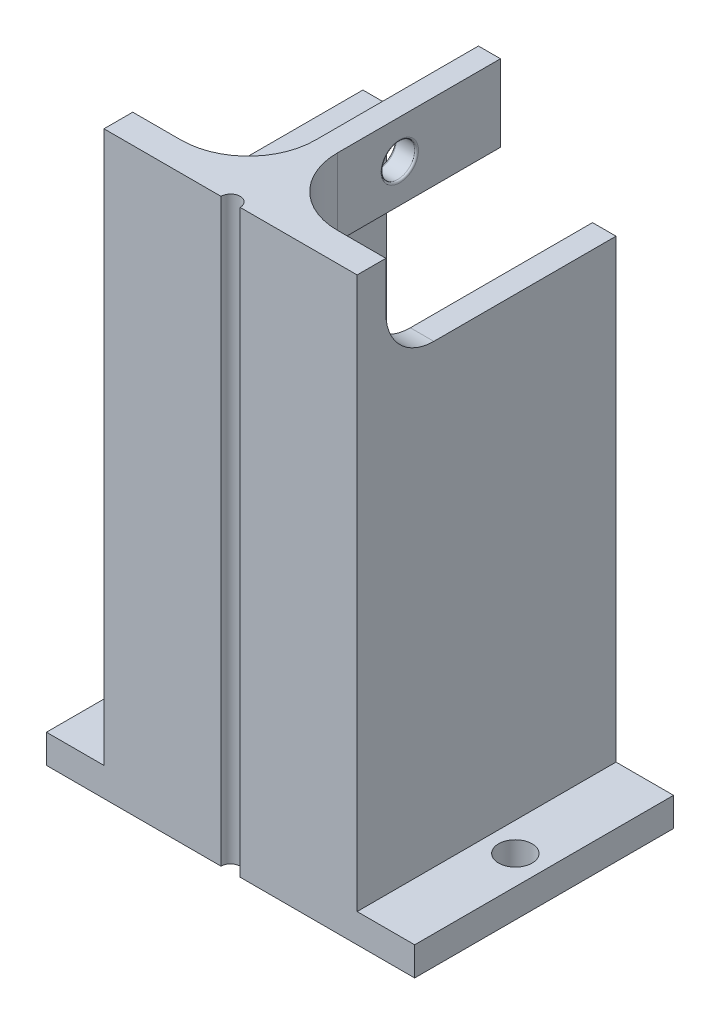
ISO-10303-21;
HEADER;
FILE_DESCRIPTION(('STEP AP214'),'2;1');
FILE_NAME('part.step','',(''),(''),'','','');
FILE_SCHEMA(('AUTOMOTIVE_DESIGN { 1 0 10303 214 1 1 1 1 }'));
ENDSEC;
DATA;
#1=APPLICATION_CONTEXT('core data for automotive mechanical design processes');
#2=APPLICATION_PROTOCOL_DEFINITION('international standard','automotive_design',2000,#1);
#3=PRODUCT_CONTEXT('',#1,'mechanical');
#4=PRODUCT('Part','Part','',(#3));
#5=PRODUCT_RELATED_PRODUCT_CATEGORY('part','',(#4));
#6=PRODUCT_DEFINITION_FORMATION('','',#4);
#7=PRODUCT_DEFINITION_CONTEXT('part definition',#1,'design');
#8=PRODUCT_DEFINITION('design','',#6,#7);
#9=PRODUCT_DEFINITION_SHAPE('','',#8);
#10=(LENGTH_UNIT() NAMED_UNIT(*) SI_UNIT(.MILLI.,.METRE.));
#11=(NAMED_UNIT(*) PLANE_ANGLE_UNIT() SI_UNIT($,.RADIAN.));
#12=(NAMED_UNIT(*) SI_UNIT($,.STERADIAN.) SOLID_ANGLE_UNIT());
#13=UNCERTAINTY_MEASURE_WITH_UNIT(LENGTH_MEASURE(1.E-05),#10,'distance_accuracy_value','');
#14=(GEOMETRIC_REPRESENTATION_CONTEXT(3) GLOBAL_UNCERTAINTY_ASSIGNED_CONTEXT((#13)) GLOBAL_UNIT_ASSIGNED_CONTEXT((#10,
#11,#12)) REPRESENTATION_CONTEXT('',''));
#15=CARTESIAN_POINT('',(0.,0.,0.));
#16=DIRECTION('',(0.,0.,1.));
#17=DIRECTION('',(1.,0.,0.));
#18=AXIS2_PLACEMENT_3D('',#15,#16,#17);
#19=CARTESIAN_POINT('',(-13.2,30.25,27.));
#20=DIRECTION('',(1.,0.,0.));
#21=DIRECTION('',(0.,1.,0.));
#22=AXIS2_PLACEMENT_3D('',#19,#20,#21);
#23=PLANE('',#22);
#24=DIRECTION('',(0.,0.,-1.));
#25=VECTOR('',#24,1.);
#26=CARTESIAN_POINT('',(-13.2,-27.25,0.));
#27=LINE('',#26,#25);
#28=CARTESIAN_POINT('',(-13.2,-27.25,27.));
#29=VERTEX_POINT('',#28);
#30=CARTESIAN_POINT('',(-13.2,-27.25,0.));
#31=VERTEX_POINT('',#30);
#32=EDGE_CURVE('E52',#29,#31,#27,.T.);
#33=ORIENTED_EDGE('',*,*,#32,.F.);
#34=DIRECTION('',(0.,-1.,0.));
#35=VECTOR('',#34,1.);
#36=CARTESIAN_POINT('',(-13.2,30.25,27.));
#37=LINE('',#36,#35);
#38=CARTESIAN_POINT('',(-13.2,30.25,27.));
#39=VERTEX_POINT('',#38);
#40=EDGE_CURVE('E229',#39,#29,#37,.T.);
#41=ORIENTED_EDGE('',*,*,#40,.F.);
#42=DIRECTION('',(0.,0.,-1.));
#43=VECTOR('',#42,1.);
#44=CARTESIAN_POINT('',(-13.2,30.25,27.));
#45=LINE('',#44,#43);
#46=CARTESIAN_POINT('',(-13.2,30.25,24.));
#47=VERTEX_POINT('',#46);
#48=EDGE_CURVE('E285',#39,#47,#45,.T.);
#49=ORIENTED_EDGE('',*,*,#48,.T.);
#50=DIRECTION('',(0.,1.,0.));
#51=VECTOR('',#50,1.);
#52=CARTESIAN_POINT('',(-13.2,30.25,24.));
#53=LINE('',#52,#51);
#54=CARTESIAN_POINT('',(-13.2,25.25,24.));
#55=VERTEX_POINT('',#54);
#56=EDGE_CURVE('E416',#55,#47,#53,.T.);
#57=ORIENTED_EDGE('',*,*,#56,.F.);
#58=CARTESIAN_POINT('',(-13.2,25.25,19.));
#59=DIRECTION('',(1.,0.,0.));
#60=DIRECTION('',(0.,1.,0.));
#61=AXIS2_PLACEMENT_3D('',#58,#59,#60);
#62=CIRCLE('',#61,5.);
#63=CARTESIAN_POINT('',(-13.2,20.25,19.));
#64=VERTEX_POINT('',#63);
#65=EDGE_CURVE('E465',#55,#64,#62,.T.);
#66=ORIENTED_EDGE('',*,*,#65,.T.);
#67=DIRECTION('',(0.,0.,1.));
#68=VECTOR('',#67,1.);
#69=CARTESIAN_POINT('',(-13.2,20.25,0.));
#70=LINE('',#69,#68);
#71=CARTESIAN_POINT('',(-13.2,20.25,0.));
#72=VERTEX_POINT('',#71);
#73=EDGE_CURVE('E411',#72,#64,#70,.T.);
#74=ORIENTED_EDGE('',*,*,#73,.F.);
#75=DIRECTION('',(0.,-1.,0.));
#76=VECTOR('',#75,1.);
#77=CARTESIAN_POINT('',(-13.2,30.25,0.));
#78=LINE('',#77,#76);
#79=EDGE_CURVE('E272',#72,#31,#78,.T.);
#80=ORIENTED_EDGE('',*,*,#79,.T.);
#81=EDGE_LOOP('',(#33,#41,#49,#57,#66,#74,#80));
#82=FACE_BOUND('',#81,.T.);
#83=ADVANCED_FACE('F35',(#82),#23,.F.);
#84=CARTESIAN_POINT('',(13.2,30.25,27.));
#85=DIRECTION('',(-1.,0.,0.));
#86=DIRECTION('',(0.,-1.,0.));
#87=AXIS2_PLACEMENT_3D('',#84,#85,#86);
#88=PLANE('',#87);
#89=DIRECTION('',(0.,0.,1.));
#90=VECTOR('',#89,1.);
#91=CARTESIAN_POINT('',(13.2,-27.25,0.));
#92=LINE('',#91,#90);
#93=CARTESIAN_POINT('',(13.2,-27.25,0.));
#94=VERTEX_POINT('',#93);
#95=CARTESIAN_POINT('',(13.2,-27.25,27.));
#96=VERTEX_POINT('',#95);
#97=EDGE_CURVE('E60',#94,#96,#92,.T.);
#98=ORIENTED_EDGE('',*,*,#97,.F.);
#99=DIRECTION('',(0.,1.,0.));
#100=VECTOR('',#99,1.);
#101=CARTESIAN_POINT('',(13.2,30.25,0.));
#102=LINE('',#101,#100);
#103=CARTESIAN_POINT('',(13.2,20.25,0.));
#104=VERTEX_POINT('',#103);
#105=EDGE_CURVE('E262',#94,#104,#102,.T.);
#106=ORIENTED_EDGE('',*,*,#105,.T.);
#107=DIRECTION('',(0.,0.,1.));
#108=VECTOR('',#107,1.);
#109=CARTESIAN_POINT('',(13.2,20.25,0.));
#110=LINE('',#109,#108);
#111=CARTESIAN_POINT('',(13.2,20.25,19.));
#112=VERTEX_POINT('',#111);
#113=EDGE_CURVE('E412',#104,#112,#110,.T.);
#114=ORIENTED_EDGE('',*,*,#113,.T.);
#115=CARTESIAN_POINT('',(13.2,25.25,19.));
#116=DIRECTION('',(-1.,0.,0.));
#117=DIRECTION('',(0.,-1.,0.));
#118=AXIS2_PLACEMENT_3D('',#115,#116,#117);
#119=CIRCLE('',#118,5.);
#120=CARTESIAN_POINT('',(13.2,25.25,24.));
#121=VERTEX_POINT('',#120);
#122=EDGE_CURVE('E458',#112,#121,#119,.T.);
#123=ORIENTED_EDGE('',*,*,#122,.T.);
#124=DIRECTION('',(0.,1.,0.));
#125=VECTOR('',#124,1.);
#126=CARTESIAN_POINT('',(13.2,30.25,24.));
#127=LINE('',#126,#125);
#128=CARTESIAN_POINT('',(13.2,30.25,24.));
#129=VERTEX_POINT('',#128);
#130=EDGE_CURVE('E415',#121,#129,#127,.T.);
#131=ORIENTED_EDGE('',*,*,#130,.T.);
#132=DIRECTION('',(0.,0.,-1.));
#133=VECTOR('',#132,1.);
#134=CARTESIAN_POINT('',(13.2,30.25,27.));
#135=LINE('',#134,#133);
#136=CARTESIAN_POINT('',(13.2,30.25,27.));
#137=VERTEX_POINT('',#136);
#138=EDGE_CURVE('E288',#137,#129,#135,.T.);
#139=ORIENTED_EDGE('',*,*,#138,.F.);
#140=DIRECTION('',(0.,1.,0.));
#141=VECTOR('',#140,1.);
#142=CARTESIAN_POINT('',(13.2,30.25,27.));
#143=LINE('',#142,#141);
#144=EDGE_CURVE('E451',#96,#137,#143,.T.);
#145=ORIENTED_EDGE('',*,*,#144,.F.);
#146=EDGE_LOOP('',(#98,#106,#114,#123,#131,#139,#145));
#147=FACE_BOUND('',#146,.T.);
#148=ADVANCED_FACE('F355',(#147),#88,.F.);
#149=CARTESIAN_POINT('',(0.,0.,27.));
#150=DIRECTION('',(0.,0.,-1.));
#151=DIRECTION('',(-1.,0.,0.));
#152=AXIS2_PLACEMENT_3D('',#149,#150,#151);
#153=PLANE('',#152);
#154=DIRECTION('',(-1.,0.,0.));
#155=VECTOR('',#154,1.);
#156=CARTESIAN_POINT('',(13.2,30.25,27.));
#157=LINE('',#156,#155);
#158=CARTESIAN_POINT('',(1.00000000000001,30.25,27.));
#159=VERTEX_POINT('',#158);
#160=EDGE_CURVE('E279',#137,#159,#157,.T.);
#161=ORIENTED_EDGE('',*,*,#160,.T.);
#162=DIRECTION('',(0.,-1.,0.));
#163=VECTOR('',#162,1.);
#164=CARTESIAN_POINT('',(1.00000000000001,30.25,27.));
#165=LINE('',#164,#163);
#166=CARTESIAN_POINT('',(1.00000000000001,-30.25,27.));
#167=VERTEX_POINT('',#166);
#168=EDGE_CURVE('E11',#159,#167,#165,.T.);
#169=ORIENTED_EDGE('',*,*,#168,.T.);
#170=DIRECTION('',(1.,0.,0.));
#171=VECTOR('',#170,1.);
#172=CARTESIAN_POINT('',(13.2,-30.25,27.));
#173=LINE('',#172,#171);
#174=CARTESIAN_POINT('',(19.2,-30.25,27.));
#175=VERTEX_POINT('',#174);
#176=EDGE_CURVE('E452',#167,#175,#173,.T.);
#177=ORIENTED_EDGE('',*,*,#176,.T.);
#178=DIRECTION('',(0.,-1.,0.));
#179=VECTOR('',#178,1.);
#180=CARTESIAN_POINT('',(19.2,-27.25,27.));
#181=LINE('',#180,#179);
#182=CARTESIAN_POINT('',(19.2,-27.25,27.));
#183=VERTEX_POINT('',#182);
#184=EDGE_CURVE('E270',#183,#175,#181,.T.);
#185=ORIENTED_EDGE('',*,*,#184,.F.);
#186=DIRECTION('',(1.,0.,0.));
#187=VECTOR('',#186,1.);
#188=CARTESIAN_POINT('',(0.,-27.25,27.));
#189=LINE('',#188,#187);
#190=EDGE_CURVE('E254',#96,#183,#189,.T.);
#191=ORIENTED_EDGE('',*,*,#190,.F.);
#192=ORIENTED_EDGE('',*,*,#144,.T.);
#193=EDGE_LOOP('',(#161,#169,#177,#185,#191,#192));
#194=FACE_BOUND('',#193,.T.);
#195=ADVANCED_FACE('F361',(#194),#153,.F.);
#196=CARTESIAN_POINT('',(0.,0.,24.));
#197=DIRECTION('',(0.,0.,1.));
#198=DIRECTION('',(1.,0.,0.));
#199=AXIS2_PLACEMENT_3D('',#196,#197,#198);
#200=PLANE('',#199);
#201=DIRECTION('',(0.,1.,0.));
#202=VECTOR('',#201,1.);
#203=CARTESIAN_POINT('',(-10.75,30.25,24.));
#204=LINE('',#203,#202);
#205=CARTESIAN_POINT('',(-10.75,-30.25,24.));
#206=VERTEX_POINT('',#205);
#207=CARTESIAN_POINT('',(-10.75,25.25,24.));
#208=VERTEX_POINT('',#207);
#209=EDGE_CURVE('E437',#206,#208,#204,.T.);
#210=ORIENTED_EDGE('',*,*,#209,.T.);
#211=DIRECTION('',(-1.,0.,0.));
#212=VECTOR('',#211,1.);
#213=CARTESIAN_POINT('',(-13.2,25.25,24.));
#214=LINE('',#213,#212);
#215=EDGE_CURVE('E471',#208,#55,#214,.T.);
#216=ORIENTED_EDGE('',*,*,#215,.T.);
#217=ORIENTED_EDGE('',*,*,#56,.T.);
#218=DIRECTION('',(1.,0.,0.));
#219=VECTOR('',#218,1.);
#220=CARTESIAN_POINT('',(-10.75,30.25,24.));
#221=LINE('',#220,#219);
#222=CARTESIAN_POINT('',(-8.15000000000001,30.25,24.));
#223=VERTEX_POINT('',#222);
#224=EDGE_CURVE('E439',#47,#223,#221,.T.);
#225=ORIENTED_EDGE('',*,*,#224,.T.);
#226=DIRECTION('',(0.,1.,0.));
#227=VECTOR('',#226,1.);
#228=CARTESIAN_POINT('',(-8.15000000000001,22.25,24.));
#229=LINE('',#228,#227);
#230=CARTESIAN_POINT('',(-8.15000000000001,18.25,24.));
#231=VERTEX_POINT('',#230);
#232=EDGE_CURVE('E304',#223,#231,#229,.F.);
#233=ORIENTED_EDGE('',*,*,#232,.T.);
#234=DIRECTION('',(-1.,0.,0.));
#235=VECTOR('',#234,1.);
#236=CARTESIAN_POINT('',(8.14999999999999,18.25,24.));
#237=LINE('',#236,#235);
#238=CARTESIAN_POINT('',(8.14999999999999,18.25,24.));
#239=VERTEX_POINT('',#238);
#240=EDGE_CURVE('E313',#231,#239,#237,.F.);
#241=ORIENTED_EDGE('',*,*,#240,.T.);
#242=DIRECTION('',(0.,-1.,0.));
#243=VECTOR('',#242,1.);
#244=CARTESIAN_POINT('',(8.14999999999999,30.25,24.));
#245=LINE('',#244,#243);
#246=CARTESIAN_POINT('',(8.14999999999999,30.25,24.));
#247=VERTEX_POINT('',#246);
#248=EDGE_CURVE('E294',#239,#247,#245,.F.);
#249=ORIENTED_EDGE('',*,*,#248,.T.);
#250=EDGE_CURVE('E390',#247,#129,#221,.T.);
#251=ORIENTED_EDGE('',*,*,#250,.T.);
#252=ORIENTED_EDGE('',*,*,#130,.F.);
#253=DIRECTION('',(-1.,0.,0.));
#254=VECTOR('',#253,1.);
#255=CARTESIAN_POINT('',(10.75,25.25,24.));
#256=LINE('',#255,#254);
#257=CARTESIAN_POINT('',(10.75,25.25,24.));
#258=VERTEX_POINT('',#257);
#259=EDGE_CURVE('E474',#121,#258,#256,.T.);
#260=ORIENTED_EDGE('',*,*,#259,.T.);
#261=DIRECTION('',(0.,-1.,0.));
#262=VECTOR('',#261,1.);
#263=CARTESIAN_POINT('',(10.75,30.25,24.));
#264=LINE('',#263,#262);
#265=CARTESIAN_POINT('',(10.75,-30.25,24.));
#266=VERTEX_POINT('',#265);
#267=EDGE_CURVE('E431',#258,#266,#264,.T.);
#268=ORIENTED_EDGE('',*,*,#267,.T.);
#269=DIRECTION('',(-1.,0.,0.));
#270=VECTOR('',#269,1.);
#271=CARTESIAN_POINT('',(-10.75,-30.25,24.));
#272=LINE('',#271,#270);
#273=EDGE_CURVE('E433',#266,#206,#272,.T.);
#274=ORIENTED_EDGE('',*,*,#273,.T.);
#275=EDGE_LOOP('',(#210,#216,#217,#225,#233,#241,#249,#251,#252,#260,#268,#274));
#276=FACE_BOUND('',#275,.T.);
#277=ADVANCED_FACE('F570',(#276),#200,.F.);
#278=CARTESIAN_POINT('',(0.,0.,0.));
#279=DIRECTION('',(0.,0.,-1.));
#280=DIRECTION('',(-1.,0.,0.));
#281=AXIS2_PLACEMENT_3D('',#278,#279,#280);
#282=PLANE('',#281);
#283=DIRECTION('',(-1.,0.,0.));
#284=VECTOR('',#283,1.);
#285=CARTESIAN_POINT('',(13.2,20.25,0.));
#286=LINE('',#285,#284);
#287=CARTESIAN_POINT('',(10.75,20.25,0.));
#288=VERTEX_POINT('',#287);
#289=EDGE_CURVE('E422',#104,#288,#286,.T.);
#290=ORIENTED_EDGE('',*,*,#289,.F.);
#291=ORIENTED_EDGE('',*,*,#105,.F.);
#292=DIRECTION('',(1.,0.,0.));
#293=VECTOR('',#292,1.);
#294=CARTESIAN_POINT('',(0.,-27.25,0.));
#295=LINE('',#294,#293);
#296=CARTESIAN_POINT('',(19.2,-27.25,0.));
#297=VERTEX_POINT('',#296);
#298=EDGE_CURVE('E261',#94,#297,#295,.T.);
#299=ORIENTED_EDGE('',*,*,#298,.T.);
#300=DIRECTION('',(0.,-1.,0.));
#301=VECTOR('',#300,1.);
#302=CARTESIAN_POINT('',(19.2,-27.25,0.));
#303=LINE('',#302,#301);
#304=CARTESIAN_POINT('',(19.2,-30.25,0.));
#305=VERTEX_POINT('',#304);
#306=EDGE_CURVE('E510',#297,#305,#303,.T.);
#307=ORIENTED_EDGE('',*,*,#306,.T.);
#308=DIRECTION('',(1.,0.,0.));
#309=VECTOR('',#308,1.);
#310=CARTESIAN_POINT('',(13.2,-30.25,0.));
#311=LINE('',#310,#309);
#312=CARTESIAN_POINT('',(10.75,-30.25,0.));
#313=VERTEX_POINT('',#312);
#314=EDGE_CURVE('E274',#313,#305,#311,.T.);
#315=ORIENTED_EDGE('',*,*,#314,.F.);
#316=DIRECTION('',(0.,-1.,0.));
#317=VECTOR('',#316,1.);
#318=CARTESIAN_POINT('',(10.75,30.25,0.));
#319=LINE('',#318,#317);
#320=EDGE_CURVE('E430',#288,#313,#319,.T.);
#321=ORIENTED_EDGE('',*,*,#320,.F.);
#322=EDGE_LOOP('',(#290,#291,#299,#307,#315,#321));
#323=FACE_BOUND('',#322,.T.);
#324=ADVANCED_FACE('F527',(#323),#282,.T.);
#325=CARTESIAN_POINT('',(13.2,-30.25,27.));
#326=DIRECTION('',(0.,1.,0.));
#327=DIRECTION('',(-1.,0.,0.));
#328=AXIS2_PLACEMENT_3D('',#325,#326,#327);
#329=PLANE('',#328);
#330=ORIENTED_EDGE('',*,*,#176,.F.);
#331=CARTESIAN_POINT('',(0.,-30.25,27.));
#332=DIRECTION('',(0.,-1.,0.));
#333=DIRECTION('',(0.,0.,-1.));
#334=AXIS2_PLACEMENT_3D('',#331,#332,#333);
#335=CIRCLE('',#334,1.);
#336=CARTESIAN_POINT('',(-0.999999999999987,-30.25,27.));
#337=VERTEX_POINT('',#336);
#338=EDGE_CURVE('E508',#337,#167,#335,.T.);
#339=ORIENTED_EDGE('',*,*,#338,.F.);
#340=CARTESIAN_POINT('',(-19.2,-30.25,27.));
#341=VERTEX_POINT('',#340);
#342=EDGE_CURVE('E450',#341,#337,#173,.T.);
#343=ORIENTED_EDGE('',*,*,#342,.F.);
#344=DIRECTION('',(0.,0.,-1.));
#345=VECTOR('',#344,1.);
#346=CARTESIAN_POINT('',(-19.2,-30.25,0.));
#347=LINE('',#346,#345);
#348=CARTESIAN_POINT('',(-19.2,-30.25,0.));
#349=VERTEX_POINT('',#348);
#350=EDGE_CURVE('E212',#341,#349,#347,.T.);
#351=ORIENTED_EDGE('',*,*,#350,.T.);
#352=CARTESIAN_POINT('',(-10.75,-30.25,0.));
#353=VERTEX_POINT('',#352);
#354=EDGE_CURVE('E281',#349,#353,#311,.T.);
#355=ORIENTED_EDGE('',*,*,#354,.T.);
#356=DIRECTION('',(0.,0.,-1.));
#357=VECTOR('',#356,1.);
#358=CARTESIAN_POINT('',(-10.75,-30.25,24.));
#359=LINE('',#358,#357);
#360=EDGE_CURVE('E275',#206,#353,#359,.T.);
#361=ORIENTED_EDGE('',*,*,#360,.F.);
#362=ORIENTED_EDGE('',*,*,#273,.F.);
#363=DIRECTION('',(0.,0.,-1.));
#364=VECTOR('',#363,1.);
#365=CARTESIAN_POINT('',(10.75,-30.25,24.));
#366=LINE('',#365,#364);
#367=EDGE_CURVE('E442',#266,#313,#366,.T.);
#368=ORIENTED_EDGE('',*,*,#367,.T.);
#369=ORIENTED_EDGE('',*,*,#314,.T.);
#370=DIRECTION('',(0.,0.,-1.));
#371=VECTOR('',#370,1.);
#372=CARTESIAN_POINT('',(19.2,-30.25,0.));
#373=LINE('',#372,#371);
#374=EDGE_CURVE('E252',#175,#305,#373,.T.);
#375=ORIENTED_EDGE('',*,*,#374,.F.);
#376=EDGE_LOOP('',(#330,#339,#343,#351,#355,#361,#362,#368,#369,#375));
#377=FACE_BOUND('',#376,.T.);
#378=CARTESIAN_POINT('',(16.2,-30.25,13.5));
#379=DIRECTION('',(0.,-1.,0.));
#380=DIRECTION('',(1.,0.,0.));
#381=AXIS2_PLACEMENT_3D('',#378,#379,#380);
#382=CIRCLE('',#381,1.75);
#383=CARTESIAN_POINT('',(17.95,-30.25,13.5));
#384=VERTEX_POINT('',#383);
#385=EDGE_CURVE('E246',#384,#384,#382,.T.);
#386=ORIENTED_EDGE('',*,*,#385,.F.);
#387=EDGE_LOOP('',(#386));
#388=FACE_BOUND('',#387,.T.);
#389=CARTESIAN_POINT('',(-16.2,-30.25,13.5));
#390=DIRECTION('',(0.,-1.,0.));
#391=DIRECTION('',(1.,0.,0.));
#392=AXIS2_PLACEMENT_3D('',#389,#390,#391);
#393=CIRCLE('',#392,1.75);
#394=CARTESIAN_POINT('',(-14.45,-30.25,13.5));
#395=VERTEX_POINT('',#394);
#396=EDGE_CURVE('E230',#395,#395,#393,.F.);
#397=ORIENTED_EDGE('',*,*,#396,.T.);
#398=EDGE_LOOP('',(#397));
#399=FACE_BOUND('',#398,.T.);
#400=ADVANCED_FACE('F364',(#377,#388,#399),#329,.F.);
#401=CARTESIAN_POINT('',(13.2,30.25,27.));
#402=DIRECTION('',(0.,-1.,0.));
#403=DIRECTION('',(1.,0.,0.));
#404=AXIS2_PLACEMENT_3D('',#401,#402,#403);
#405=PLANE('',#404);
#406=CARTESIAN_POINT('',(-0.999999999999987,30.25,27.));
#407=VERTEX_POINT('',#406);
#408=EDGE_CURVE('E454',#407,#39,#157,.T.);
#409=ORIENTED_EDGE('',*,*,#408,.F.);
#410=CARTESIAN_POINT('',(0.,30.25,27.));
#411=DIRECTION('',(0.,-1.,0.));
#412=DIRECTION('',(0.,0.,-1.));
#413=AXIS2_PLACEMENT_3D('',#410,#411,#412);
#414=CIRCLE('',#413,1.);
#415=EDGE_CURVE('E507',#407,#159,#414,.T.);
#416=ORIENTED_EDGE('',*,*,#415,.T.);
#417=ORIENTED_EDGE('',*,*,#160,.F.);
#418=ORIENTED_EDGE('',*,*,#138,.T.);
#419=ORIENTED_EDGE('',*,*,#250,.F.);
#420=CARTESIAN_POINT('',(8.14999999999999,30.25,17.));
#421=DIRECTION('',(0.,-1.,0.));
#422=DIRECTION('',(1.,0.,0.));
#423=AXIS2_PLACEMENT_3D('',#420,#421,#422);
#424=CIRCLE('',#423,7.);
#425=CARTESIAN_POINT('',(1.14999999999999,30.25,17.));
#426=VERTEX_POINT('',#425);
#427=EDGE_CURVE('E299',#247,#426,#424,.T.);
#428=ORIENTED_EDGE('',*,*,#427,.T.);
#429=DIRECTION('',(0.,0.,1.));
#430=VECTOR('',#429,1.);
#431=CARTESIAN_POINT('',(1.14999999999999,30.25,0.));
#432=LINE('',#431,#430);
#433=CARTESIAN_POINT('',(1.14999999999999,30.25,0.));
#434=VERTEX_POINT('',#433);
#435=EDGE_CURVE('E387',#434,#426,#432,.T.);
#436=ORIENTED_EDGE('',*,*,#435,.F.);
#437=DIRECTION('',(1.,0.,0.));
#438=VECTOR('',#437,1.);
#439=CARTESIAN_POINT('',(-1.15000000000001,30.25,0.));
#440=LINE('',#439,#438);
#441=CARTESIAN_POINT('',(-1.15000000000001,30.25,0.));
#442=VERTEX_POINT('',#441);
#443=EDGE_CURVE('E398',#442,#434,#440,.T.);
#444=ORIENTED_EDGE('',*,*,#443,.F.);
#445=DIRECTION('',(0.,0.,1.));
#446=VECTOR('',#445,1.);
#447=CARTESIAN_POINT('',(-1.15000000000001,30.25,0.));
#448=LINE('',#447,#446);
#449=CARTESIAN_POINT('',(-1.15000000000001,30.25,17.));
#450=VERTEX_POINT('',#449);
#451=EDGE_CURVE('E397',#442,#450,#448,.T.);
#452=ORIENTED_EDGE('',*,*,#451,.T.);
#453=CARTESIAN_POINT('',(-8.15000000000001,30.25,17.));
#454=DIRECTION('',(0.,-1.,0.));
#455=DIRECTION('',(1.,0.,0.));
#456=AXIS2_PLACEMENT_3D('',#453,#454,#455);
#457=CIRCLE('',#456,7.);
#458=EDGE_CURVE('E306',#450,#223,#457,.T.);
#459=ORIENTED_EDGE('',*,*,#458,.T.);
#460=ORIENTED_EDGE('',*,*,#224,.F.);
#461=ORIENTED_EDGE('',*,*,#48,.F.);
#462=EDGE_LOOP('',(#409,#416,#417,#418,#419,#428,#436,#444,#452,#459,#460,#461));
#463=FACE_BOUND('',#462,.T.);
#464=ADVANCED_FACE('F385',(#463),#405,.F.);
#465=ORIENTED_EDGE('',*,*,#342,.T.);
#466=DIRECTION('',(0.,-1.,0.));
#467=VECTOR('',#466,1.);
#468=CARTESIAN_POINT('',(-0.999999999999987,30.25,27.));
#469=LINE('',#468,#467);
#470=EDGE_CURVE('E44',#337,#407,#469,.F.);
#471=ORIENTED_EDGE('',*,*,#470,.T.);
#472=ORIENTED_EDGE('',*,*,#408,.T.);
#473=ORIENTED_EDGE('',*,*,#40,.T.);
#474=DIRECTION('',(-1.,0.,0.));
#475=VECTOR('',#474,1.);
#476=CARTESIAN_POINT('',(0.,-27.25,27.));
#477=LINE('',#476,#475);
#478=CARTESIAN_POINT('',(-19.2,-27.25,27.));
#479=VERTEX_POINT('',#478);
#480=EDGE_CURVE('E223',#29,#479,#477,.T.);
#481=ORIENTED_EDGE('',*,*,#480,.T.);
#482=DIRECTION('',(0.,-1.,0.));
#483=VECTOR('',#482,1.);
#484=CARTESIAN_POINT('',(-19.2,-27.25,27.));
#485=LINE('',#484,#483);
#486=EDGE_CURVE('E206',#479,#341,#485,.T.);
#487=ORIENTED_EDGE('',*,*,#486,.T.);
#488=EDGE_LOOP('',(#465,#471,#472,#473,#481,#487));
#489=FACE_BOUND('',#488,.T.);
#490=ADVANCED_FACE('F228',(#489),#153,.F.);
#491=CARTESIAN_POINT('',(-10.75,20.25,0.));
#492=VERTEX_POINT('',#491);
#493=EDGE_CURVE('E418',#492,#72,#286,.T.);
#494=ORIENTED_EDGE('',*,*,#493,.F.);
#495=DIRECTION('',(0.,1.,0.));
#496=VECTOR('',#495,1.);
#497=CARTESIAN_POINT('',(-10.75,30.25,0.));
#498=LINE('',#497,#496);
#499=EDGE_CURVE('E434',#353,#492,#498,.T.);
#500=ORIENTED_EDGE('',*,*,#499,.F.);
#501=ORIENTED_EDGE('',*,*,#354,.F.);
#502=DIRECTION('',(0.,-1.,0.));
#503=VECTOR('',#502,1.);
#504=CARTESIAN_POINT('',(-19.2,-27.25,0.));
#505=LINE('',#504,#503);
#506=CARTESIAN_POINT('',(-19.2,-27.25,0.));
#507=VERTEX_POINT('',#506);
#508=EDGE_CURVE('E216',#507,#349,#505,.T.);
#509=ORIENTED_EDGE('',*,*,#508,.F.);
#510=DIRECTION('',(-1.,0.,0.));
#511=VECTOR('',#510,1.);
#512=CARTESIAN_POINT('',(0.,-27.25,0.));
#513=LINE('',#512,#511);
#514=EDGE_CURVE('E225',#31,#507,#513,.T.);
#515=ORIENTED_EDGE('',*,*,#514,.F.);
#516=ORIENTED_EDGE('',*,*,#79,.F.);
#517=EDGE_LOOP('',(#494,#500,#501,#509,#515,#516));
#518=FACE_BOUND('',#517,.T.);
#519=ADVANCED_FACE('F581',(#518),#282,.T.);
#520=CARTESIAN_POINT('',(10.75,30.25,24.));
#521=DIRECTION('',(1.,0.,0.));
#522=DIRECTION('',(0.,0.,-1.));
#523=AXIS2_PLACEMENT_3D('',#520,#521,#522);
#524=PLANE('',#523);
#525=ORIENTED_EDGE('',*,*,#267,.F.);
#526=CARTESIAN_POINT('',(10.75,25.25,19.));
#527=DIRECTION('',(1.,0.,0.));
#528=DIRECTION('',(0.,0.,-1.));
#529=AXIS2_PLACEMENT_3D('',#526,#527,#528);
#530=CIRCLE('',#529,5.);
#531=CARTESIAN_POINT('',(10.75,20.25,19.));
#532=VERTEX_POINT('',#531);
#533=EDGE_CURVE('E460',#258,#532,#530,.T.);
#534=ORIENTED_EDGE('',*,*,#533,.T.);
#535=DIRECTION('',(0.,0.,-1.));
#536=VECTOR('',#535,1.);
#537=CARTESIAN_POINT('',(10.75,20.25,24.));
#538=LINE('',#537,#536);
#539=EDGE_CURVE('E428',#532,#288,#538,.T.);
#540=ORIENTED_EDGE('',*,*,#539,.T.);
#541=ORIENTED_EDGE('',*,*,#320,.T.);
#542=ORIENTED_EDGE('',*,*,#367,.F.);
#543=EDGE_LOOP('',(#525,#534,#540,#541,#542));
#544=FACE_BOUND('',#543,.T.);
#545=ADVANCED_FACE('F577',(#544),#524,.F.);
#546=CARTESIAN_POINT('',(-10.75,30.25,24.));
#547=DIRECTION('',(-1.,0.,0.));
#548=DIRECTION('',(0.,0.,1.));
#549=AXIS2_PLACEMENT_3D('',#546,#547,#548);
#550=PLANE('',#549);
#551=ORIENTED_EDGE('',*,*,#499,.T.);
#552=DIRECTION('',(0.,0.,1.));
#553=VECTOR('',#552,1.);
#554=CARTESIAN_POINT('',(-10.75,20.25,24.));
#555=LINE('',#554,#553);
#556=CARTESIAN_POINT('',(-10.75,20.25,19.));
#557=VERTEX_POINT('',#556);
#558=EDGE_CURVE('E425',#492,#557,#555,.T.);
#559=ORIENTED_EDGE('',*,*,#558,.T.);
#560=CARTESIAN_POINT('',(-10.75,25.25,19.));
#561=DIRECTION('',(-1.,0.,0.));
#562=DIRECTION('',(0.,0.,1.));
#563=AXIS2_PLACEMENT_3D('',#560,#561,#562);
#564=CIRCLE('',#563,5.);
#565=EDGE_CURVE('E462',#557,#208,#564,.T.);
#566=ORIENTED_EDGE('',*,*,#565,.T.);
#567=ORIENTED_EDGE('',*,*,#209,.F.);
#568=ORIENTED_EDGE('',*,*,#360,.T.);
#569=EDGE_LOOP('',(#551,#559,#566,#567,#568));
#570=FACE_BOUND('',#569,.T.);
#571=ADVANCED_FACE('F574',(#570),#550,.F.);
#572=CARTESIAN_POINT('',(13.2,20.25,0.));
#573=DIRECTION('',(0.,-1.,0.));
#574=DIRECTION('',(1.,0.,0.));
#575=AXIS2_PLACEMENT_3D('',#572,#573,#574);
#576=PLANE('',#575);
#577=ORIENTED_EDGE('',*,*,#73,.T.);
#578=DIRECTION('',(-1.,0.,0.));
#579=VECTOR('',#578,1.);
#580=CARTESIAN_POINT('',(-10.75,20.25,19.));
#581=LINE('',#580,#579);
#582=EDGE_CURVE('E469',#64,#557,#581,.F.);
#583=ORIENTED_EDGE('',*,*,#582,.T.);
#584=ORIENTED_EDGE('',*,*,#558,.F.);
#585=ORIENTED_EDGE('',*,*,#493,.T.);
#586=EDGE_LOOP('',(#577,#583,#584,#585));
#587=FACE_BOUND('',#586,.T.);
#588=ADVANCED_FACE('F568',(#587),#576,.F.);
#589=ORIENTED_EDGE('',*,*,#539,.F.);
#590=DIRECTION('',(-1.,0.,0.));
#591=VECTOR('',#590,1.);
#592=CARTESIAN_POINT('',(13.2,20.25,19.));
#593=LINE('',#592,#591);
#594=EDGE_CURVE('E467',#532,#112,#593,.F.);
#595=ORIENTED_EDGE('',*,*,#594,.T.);
#596=ORIENTED_EDGE('',*,*,#113,.F.);
#597=ORIENTED_EDGE('',*,*,#289,.T.);
#598=EDGE_LOOP('',(#589,#595,#596,#597));
#599=FACE_BOUND('',#598,.T.);
#600=ADVANCED_FACE('F564',(#599),#576,.F.);
#601=CARTESIAN_POINT('',(1.14999999999999,30.25,0.));
#602=DIRECTION('',(-1.,0.,0.));
#603=DIRECTION('',(0.,-1.,0.));
#604=AXIS2_PLACEMENT_3D('',#601,#602,#603);
#605=PLANE('',#604);
#606=CARTESIAN_POINT('',(1.14999999999999,26.25,10.5));
#607=DIRECTION('',(-1.,0.,0.));
#608=DIRECTION('',(0.,-1.,0.));
#609=AXIS2_PLACEMENT_3D('',#606,#607,#608);
#610=CIRCLE('',#609,1.95);
#611=CARTESIAN_POINT('',(1.14999999999999,24.3,10.5));
#612=VERTEX_POINT('',#611);
#613=EDGE_CURVE('E477',#612,#612,#610,.T.);
#614=ORIENTED_EDGE('',*,*,#613,.T.);
#615=EDGE_LOOP('',(#614));
#616=FACE_BOUND('',#615,.T.);
#617=ORIENTED_EDGE('',*,*,#435,.T.);
#618=DIRECTION('',(0.,-1.,0.));
#619=VECTOR('',#618,1.);
#620=CARTESIAN_POINT('',(1.14999999999999,22.25,17.));
#621=LINE('',#620,#619);
#622=CARTESIAN_POINT('',(1.14999999999999,22.25,17.));
#623=VERTEX_POINT('',#622);
#624=EDGE_CURVE('E291',#426,#623,#621,.T.);
#625=ORIENTED_EDGE('',*,*,#624,.T.);
#626=DIRECTION('',(0.,0.,1.));
#627=VECTOR('',#626,1.);
#628=CARTESIAN_POINT('',(1.14999999999999,22.25,0.));
#629=LINE('',#628,#627);
#630=CARTESIAN_POINT('',(1.14999999999999,22.25,0.));
#631=VERTEX_POINT('',#630);
#632=EDGE_CURVE('E409',#631,#623,#629,.T.);
#633=ORIENTED_EDGE('',*,*,#632,.F.);
#634=DIRECTION('',(0.,-1.,0.));
#635=VECTOR('',#634,1.);
#636=CARTESIAN_POINT('',(1.14999999999999,30.25,0.));
#637=LINE('',#636,#635);
#638=EDGE_CURVE('E396',#434,#631,#637,.T.);
#639=ORIENTED_EDGE('',*,*,#638,.F.);
#640=EDGE_LOOP('',(#617,#625,#633,#639));
#641=FACE_BOUND('',#640,.T.);
#642=ADVANCED_FACE('F392',(#616,#641),#605,.F.);
#643=CARTESIAN_POINT('',(-1.15000000000001,22.25,0.));
#644=DIRECTION('',(0.,1.,0.));
#645=DIRECTION('',(0.,0.,1.));
#646=AXIS2_PLACEMENT_3D('',#643,#644,#645);
#647=PLANE('',#646);
#648=CARTESIAN_POINT('',(8.14999999999999,22.25,17.));
#649=DIRECTION('',(0.,1.,0.));
#650=DIRECTION('',(0.,0.,1.));
#651=AXIS2_PLACEMENT_3D('',#648,#649,#650);
#652=CIRCLE('',#651,7.);
#653=CARTESIAN_POINT('',(1.82544467966323,22.25,20.));
#654=VERTEX_POINT('',#653);
#655=EDGE_CURVE('E296',#623,#654,#652,.T.);
#656=ORIENTED_EDGE('',*,*,#655,.T.);
#657=DIRECTION('',(-1.,0.,0.));
#658=VECTOR('',#657,1.);
#659=CARTESIAN_POINT('',(-8.15000000000001,22.25,20.));
#660=LINE('',#659,#658);
#661=CARTESIAN_POINT('',(-1.82544467966325,22.25,20.));
#662=VERTEX_POINT('',#661);
#663=EDGE_CURVE('E310',#654,#662,#660,.T.);
#664=ORIENTED_EDGE('',*,*,#663,.T.);
#665=CARTESIAN_POINT('',(-8.15000000000001,22.25,17.));
#666=DIRECTION('',(0.,1.,0.));
#667=DIRECTION('',(0.,0.,1.));
#668=AXIS2_PLACEMENT_3D('',#665,#666,#667);
#669=CIRCLE('',#668,7.);
#670=CARTESIAN_POINT('',(-1.15000000000001,22.25,17.));
#671=VERTEX_POINT('',#670);
#672=EDGE_CURVE('E308',#662,#671,#669,.T.);
#673=ORIENTED_EDGE('',*,*,#672,.T.);
#674=DIRECTION('',(0.,0.,1.));
#675=VECTOR('',#674,1.);
#676=CARTESIAN_POINT('',(-1.15000000000001,22.25,0.));
#677=LINE('',#676,#675);
#678=CARTESIAN_POINT('',(-1.15000000000001,22.25,0.));
#679=VERTEX_POINT('',#678);
#680=EDGE_CURVE('E401',#679,#671,#677,.T.);
#681=ORIENTED_EDGE('',*,*,#680,.F.);
#682=DIRECTION('',(-1.,0.,0.));
#683=VECTOR('',#682,1.);
#684=CARTESIAN_POINT('',(-1.15000000000001,22.25,0.));
#685=LINE('',#684,#683);
#686=EDGE_CURVE('E503',#631,#679,#685,.T.);
#687=ORIENTED_EDGE('',*,*,#686,.F.);
#688=ORIENTED_EDGE('',*,*,#632,.T.);
#689=EDGE_LOOP('',(#656,#664,#673,#681,#687,#688));
#690=FACE_BOUND('',#689,.T.);
#691=ADVANCED_FACE('F493',(#690),#647,.F.);
#692=CARTESIAN_POINT('',(-1.15000000000001,30.25,0.));
#693=DIRECTION('',(1.,0.,0.));
#694=DIRECTION('',(0.,1.,0.));
#695=AXIS2_PLACEMENT_3D('',#692,#693,#694);
#696=PLANE('',#695);
#697=CARTESIAN_POINT('',(-1.15000000000001,26.25,10.5));
#698=DIRECTION('',(1.,0.,0.));
#699=DIRECTION('',(0.,1.,0.));
#700=AXIS2_PLACEMENT_3D('',#697,#698,#699);
#701=CIRCLE('',#700,1.95);
#702=CARTESIAN_POINT('',(-1.15000000000001,28.2,10.5));
#703=VERTEX_POINT('',#702);
#704=EDGE_CURVE('E480',#703,#703,#701,.T.);
#705=ORIENTED_EDGE('',*,*,#704,.T.);
#706=EDGE_LOOP('',(#705));
#707=FACE_BOUND('',#706,.T.);
#708=ORIENTED_EDGE('',*,*,#680,.T.);
#709=DIRECTION('',(0.,1.,0.));
#710=VECTOR('',#709,1.);
#711=CARTESIAN_POINT('',(-1.15000000000001,30.25,17.));
#712=LINE('',#711,#710);
#713=EDGE_CURVE('E301',#671,#450,#712,.T.);
#714=ORIENTED_EDGE('',*,*,#713,.T.);
#715=ORIENTED_EDGE('',*,*,#451,.F.);
#716=DIRECTION('',(0.,1.,0.));
#717=VECTOR('',#716,1.);
#718=CARTESIAN_POINT('',(-1.15000000000001,30.25,0.));
#719=LINE('',#718,#717);
#720=EDGE_CURVE('E403',#679,#442,#719,.T.);
#721=ORIENTED_EDGE('',*,*,#720,.F.);
#722=EDGE_LOOP('',(#708,#714,#715,#721));
#723=FACE_BOUND('',#722,.T.);
#724=ADVANCED_FACE('F500',(#707,#723),#696,.F.);
#725=CARTESIAN_POINT('',(0.,0.,0.));
#726=DIRECTION('',(0.,0.,1.));
#727=DIRECTION('',(1.,0.,0.));
#728=AXIS2_PLACEMENT_3D('',#725,#726,#727);
#729=PLANE('',#728);
#730=ORIENTED_EDGE('',*,*,#638,.T.);
#731=ORIENTED_EDGE('',*,*,#686,.T.);
#732=ORIENTED_EDGE('',*,*,#720,.T.);
#733=ORIENTED_EDGE('',*,*,#443,.T.);
#734=EDGE_LOOP('',(#730,#731,#732,#733));
#735=FACE_BOUND('',#734,.T.);
#736=ADVANCED_FACE('F375',(#735),#729,.F.);
#737=CARTESIAN_POINT('',(-13.201,26.25,10.5));
#738=DIRECTION('',(1.,0.,0.));
#739=DIRECTION('',(0.,1.,0.));
#740=AXIS2_PLACEMENT_3D('',#737,#738,#739);
#741=CYLINDRICAL_SURFACE('',#740,1.75);
#742=CARTESIAN_POINT('',(-0.950000000000008,26.25,10.5));
#743=DIRECTION('',(1.,0.,0.));
#744=DIRECTION('',(0.,1.,0.));
#745=AXIS2_PLACEMENT_3D('',#742,#743,#744);
#746=CIRCLE('',#745,1.75);
#747=CARTESIAN_POINT('',(-0.950000000000008,28.,10.5));
#748=VERTEX_POINT('',#747);
#749=EDGE_CURVE('E483',#748,#748,#746,.F.);
#750=ORIENTED_EDGE('',*,*,#749,.T.);
#751=EDGE_LOOP('',(#750));
#752=FACE_BOUND('',#751,.T.);
#753=CARTESIAN_POINT('',(0.949999999999993,26.25,10.5));
#754=DIRECTION('',(-1.,0.,0.));
#755=DIRECTION('',(0.,-1.,0.));
#756=AXIS2_PLACEMENT_3D('',#753,#754,#755);
#757=CIRCLE('',#756,1.75);
#758=CARTESIAN_POINT('',(0.949999999999992,24.5,10.5));
#759=VERTEX_POINT('',#758);
#760=EDGE_CURVE('E485',#759,#759,#757,.F.);
#761=ORIENTED_EDGE('',*,*,#760,.T.);
#762=EDGE_LOOP('',(#761));
#763=FACE_BOUND('',#762,.T.);
#764=ADVANCED_FACE('F368',(#752,#763),#741,.F.);
#765=CARTESIAN_POINT('',(8.14999999999999,30.25,17.));
#766=DIRECTION('',(0.,1.,0.));
#767=DIRECTION('',(-1.,0.,0.));
#768=AXIS2_PLACEMENT_3D('',#765,#766,#767);
#769=CYLINDRICAL_SURFACE('',#768,7.);
#770=ORIENTED_EDGE('',*,*,#427,.F.);
#771=ORIENTED_EDGE('',*,*,#248,.F.);
#772=CARTESIAN_POINT('',(1.82544467966323,22.25,20.));
#773=CARTESIAN_POINT('',(1.88289913861301,22.2500108180571,20.1211948349964));
#774=CARTESIAN_POINT('',(1.94385145010761,22.2444944558531,20.2406321474774));
#775=CARTESIAN_POINT('',(2.07197956747063,22.2234366704253,20.4749611134853));
#776=CARTESIAN_POINT('',(2.13914476936907,22.2079120681052,20.589860051446));
#777=CARTESIAN_POINT('',(2.27840861495501,22.1680648982223,20.8133462459177));
#778=CARTESIAN_POINT('',(2.35044985546211,22.1438338212837,20.9219859867562));
#779=CARTESIAN_POINT('',(2.49945171528498,22.0875216066444,21.1337725724366));
#780=CARTESIAN_POINT('',(2.57641493353947,22.0554362959848,21.2369164617406));
#781=CARTESIAN_POINT('',(2.7565752548618,21.9744847796978,21.4651490702139));
#782=CARTESIAN_POINT('',(2.86113038086126,21.9234323504561,21.5883949748541));
#783=CARTESIAN_POINT('',(3.07606465761821,21.8118034734542,21.82501425562));
#784=CARTESIAN_POINT('',(3.18644472018022,21.7512255316653,21.9383860787039));
#785=CARTESIAN_POINT('',(3.52593988562918,21.5568953730331,22.2646753551488));
#786=CARTESIAN_POINT('',(3.76257484070079,21.4109401466756,22.4627270334463));
#787=CARTESIAN_POINT('',(4.17628653970651,21.1436800806013,22.7666712753642));
#788=CARTESIAN_POINT('',(4.35005296784093,21.0280248955011,22.8824252923564));
#789=CARTESIAN_POINT('',(4.70279257515454,20.7880251029739,23.0958363613451));
#790=CARTESIAN_POINT('',(4.88176786456772,20.6636769443893,23.1934859573293));
#791=CARTESIAN_POINT('',(5.24358960321607,20.4083701772435,23.3712977495797));
#792=CARTESIAN_POINT('',(5.42643622931343,20.2774112662897,23.4514591449974));
#793=CARTESIAN_POINT('',(5.79498224271491,20.0105354699768,23.5949200336052));
#794=CARTESIAN_POINT('',(5.98068104487578,19.8746195939114,23.6582229378206));
#795=CARTESIAN_POINT('',(6.49179998599059,19.4976608802579,23.8091728140602));
#796=CARTESIAN_POINT('',(6.8194106608625,19.252906681078,23.8804192713453));
#797=CARTESIAN_POINT('',(7.47698775011791,18.7587324998657,23.9754668904879));
#798=CARTESIAN_POINT('',(7.80694842670362,18.5093223893703,23.9993589769916));
#799=CARTESIAN_POINT('',(8.14110106307454,18.2567269635588,23.9999957519401));
#800=CARTESIAN_POINT('',(8.14555055713983,18.2533634621837,23.9999999941052));
#801=CARTESIAN_POINT('',(8.14999999999999,18.25,24.));
#802=B_SPLINE_CURVE_WITH_KNOTS('',3,(#772,#773,#774,#775,#776,#777,#778,#779,#780,#781,#782,
#783,#784,#785,#786,#787,#788,#789,#790,#791,#792,#793,#794,#795,#796,#797,#798,#799,#800,#801),
.UNSPECIFIED.,.F.,.F.,(4,2,2,2,2,2,2,2,2,2,2,2,2,2,4),(0.,0.40207135772927,0.803468707510977,
1.20076580645605,1.59827444947102,2.10597656521551,2.61375839105276,3.6334423162711,
4.34870398867296,5.06425957883364,5.77984793002369,6.49529138404871,7.73757985134309,
8.97748069343259,8.99421389880347),.UNSPECIFIED.);
#803=EDGE_CURVE('E324',#239,#654,#802,.F.);
#804=ORIENTED_EDGE('',*,*,#803,.T.);
#805=ORIENTED_EDGE('',*,*,#655,.F.);
#806=ORIENTED_EDGE('',*,*,#624,.F.);
#807=EDGE_LOOP('',(#770,#771,#804,#805,#806));
#808=FACE_BOUND('',#807,.T.);
#809=ADVANCED_FACE('F365',(#808),#769,.F.);
#810=CARTESIAN_POINT('',(-8.15000000000001,30.25,17.));
#811=DIRECTION('',(0.,-1.,0.));
#812=DIRECTION('',(1.,0.,0.));
#813=AXIS2_PLACEMENT_3D('',#810,#811,#812);
#814=CYLINDRICAL_SURFACE('',#813,7.);
#815=ORIENTED_EDGE('',*,*,#672,.F.);
#816=CARTESIAN_POINT('',(-1.82544467966325,22.25,20.));
#817=CARTESIAN_POINT('',(-1.88289913861303,22.2500108180571,20.1211948349964));
#818=CARTESIAN_POINT('',(-1.94385145010762,22.2444944558531,20.2406321474774));
#819=CARTESIAN_POINT('',(-2.07197956747064,22.2234366704253,20.4749611134853));
#820=CARTESIAN_POINT('',(-2.13914476936909,22.2079120681052,20.589860051446));
#821=CARTESIAN_POINT('',(-2.27840861495502,22.1680648982223,20.8133462459177));
#822=CARTESIAN_POINT('',(-2.35044985546212,22.1438338212837,20.9219859867562));
#823=CARTESIAN_POINT('',(-2.499451715285,22.0875216066444,21.1337725724366));
#824=CARTESIAN_POINT('',(-2.57641493353948,22.0554362959848,21.2369164617406));
#825=CARTESIAN_POINT('',(-2.75657525486182,21.9744847796978,21.4651490702139));
#826=CARTESIAN_POINT('',(-2.86113038086128,21.9234323504561,21.5883949748541));
#827=CARTESIAN_POINT('',(-3.07606465761823,21.8118034734541,21.82501425562));
#828=CARTESIAN_POINT('',(-3.18644472018025,21.7512255316653,21.9383860787039));
#829=CARTESIAN_POINT('',(-3.5259398856292,21.5568953730331,22.2646753551488));
#830=CARTESIAN_POINT('',(-3.76257484070081,21.4109401466756,22.4627270334463));
#831=CARTESIAN_POINT('',(-4.17628653970652,21.1436800806013,22.7666712753642));
#832=CARTESIAN_POINT('',(-4.35005296784094,21.0280248955011,22.8824252923564));
#833=CARTESIAN_POINT('',(-4.70279257515456,20.7880251029739,23.0958363613451));
#834=CARTESIAN_POINT('',(-4.88176786456774,20.6636769443893,23.1934859573293));
#835=CARTESIAN_POINT('',(-5.24358960321608,20.4083701772435,23.3712977495797));
#836=CARTESIAN_POINT('',(-5.42643622931344,20.2774112662897,23.4514591449974));
#837=CARTESIAN_POINT('',(-5.79498224271494,20.0105354699769,23.5949200336052));
#838=CARTESIAN_POINT('',(-5.98068104487584,19.8746195939114,23.6582229378206));
#839=CARTESIAN_POINT('',(-6.49179998599055,19.4976608802578,23.8091728140602));
#840=CARTESIAN_POINT('',(-6.81941066086223,19.2529066810776,23.8804192713453));
#841=CARTESIAN_POINT('',(-7.47698775011822,18.7587324998661,23.9754668904879));
#842=CARTESIAN_POINT('',(-7.80694842670473,18.5093223893717,23.9993589769916));
#843=CARTESIAN_POINT('',(-8.14110106307458,18.2567269635588,23.9999957519401));
#844=CARTESIAN_POINT('',(-8.14555055713986,18.2533634621837,23.9999999941052));
#845=CARTESIAN_POINT('',(-8.15000000000001,18.25,24.));
#846=B_SPLINE_CURVE_WITH_KNOTS('',3,(#816,#817,#818,#819,#820,#821,#822,#823,#824,#825,#826,
#827,#828,#829,#830,#831,#832,#833,#834,#835,#836,#837,#838,#839,#840,#841,#842,#843,#844,#845),
.UNSPECIFIED.,.F.,.F.,(4,2,2,2,2,2,2,2,2,2,2,2,2,2,4),(0.,0.402071357729262,0.803468707510961,
1.20076580645604,1.59827444947102,2.10597656521551,2.61375839105277,3.6334423162711,
4.34870398867296,5.06425957883363,5.77984793002369,6.49529138404872,7.73757985134309,
8.97748069343259,8.99421389880347),.UNSPECIFIED.);
#847=EDGE_CURVE('E316',#662,#231,#846,.T.);
#848=ORIENTED_EDGE('',*,*,#847,.T.);
#849=ORIENTED_EDGE('',*,*,#232,.F.);
#850=ORIENTED_EDGE('',*,*,#458,.F.);
#851=ORIENTED_EDGE('',*,*,#713,.F.);
#852=EDGE_LOOP('',(#815,#848,#849,#850,#851));
#853=FACE_BOUND('',#852,.T.);
#854=ADVANCED_FACE('F330',(#853),#814,.F.);
#855=CARTESIAN_POINT('',(-1.15000000000001,18.25,20.));
#856=DIRECTION('',(1.,0.,0.));
#857=DIRECTION('',(0.,0.,-1.));
#858=AXIS2_PLACEMENT_3D('',#855,#856,#857);
#859=CYLINDRICAL_SURFACE('',#858,4.);
#860=ORIENTED_EDGE('',*,*,#803,.F.);
#861=ORIENTED_EDGE('',*,*,#240,.F.);
#862=ORIENTED_EDGE('',*,*,#847,.F.);
#863=ORIENTED_EDGE('',*,*,#663,.F.);
#864=EDGE_LOOP('',(#860,#861,#862,#863));
#865=FACE_BOUND('',#864,.T.);
#866=ADVANCED_FACE('F332',(#865),#859,.F.);
#867=CARTESIAN_POINT('',(-0.950000000000008,26.25,10.5));
#868=DIRECTION('',(1.,0.,0.));
#869=DIRECTION('',(0.,1.,0.));
#870=AXIS2_PLACEMENT_3D('',#867,#868,#869);
#871=TOROIDAL_SURFACE('',#870,1.95,0.2);
#872=ORIENTED_EDGE('',*,*,#704,.F.);
#873=EDGE_LOOP('',(#872));
#874=FACE_BOUND('',#873,.T.);
#875=ORIENTED_EDGE('',*,*,#749,.F.);
#876=EDGE_LOOP('',(#875));
#877=FACE_BOUND('',#876,.T.);
#878=ADVANCED_FACE('F336',(#874,#877),#871,.T.);
#879=CARTESIAN_POINT('',(0.949999999999993,26.25,10.5));
#880=DIRECTION('',(-1.,0.,0.));
#881=DIRECTION('',(0.,-1.,0.));
#882=AXIS2_PLACEMENT_3D('',#879,#880,#881);
#883=TOROIDAL_SURFACE('',#882,1.95,0.2);
#884=ORIENTED_EDGE('',*,*,#613,.F.);
#885=EDGE_LOOP('',(#884));
#886=FACE_BOUND('',#885,.T.);
#887=ORIENTED_EDGE('',*,*,#760,.F.);
#888=EDGE_LOOP('',(#887));
#889=FACE_BOUND('',#888,.T.);
#890=ADVANCED_FACE('F341',(#886,#889),#883,.T.);
#891=CARTESIAN_POINT('',(0.,25.25,19.));
#892=DIRECTION('',(1.,0.,0.));
#893=DIRECTION('',(0.,1.,0.));
#894=AXIS2_PLACEMENT_3D('',#891,#892,#893);
#895=CYLINDRICAL_SURFACE('',#894,5.);
#896=ORIENTED_EDGE('',*,*,#565,.F.);
#897=ORIENTED_EDGE('',*,*,#582,.F.);
#898=ORIENTED_EDGE('',*,*,#65,.F.);
#899=ORIENTED_EDGE('',*,*,#215,.F.);
#900=EDGE_LOOP('',(#896,#897,#898,#899));
#901=FACE_BOUND('',#900,.T.);
#902=ADVANCED_FACE('F344',(#901),#895,.F.);
#903=CARTESIAN_POINT('',(0.,25.25,19.));
#904=DIRECTION('',(1.,0.,0.));
#905=DIRECTION('',(0.,1.,0.));
#906=AXIS2_PLACEMENT_3D('',#903,#904,#905);
#907=CYLINDRICAL_SURFACE('',#906,5.);
#908=ORIENTED_EDGE('',*,*,#122,.F.);
#909=ORIENTED_EDGE('',*,*,#594,.F.);
#910=ORIENTED_EDGE('',*,*,#533,.F.);
#911=ORIENTED_EDGE('',*,*,#259,.F.);
#912=EDGE_LOOP('',(#908,#909,#910,#911));
#913=FACE_BOUND('',#912,.T.);
#914=ADVANCED_FACE('F37',(#913),#907,.F.);
#915=CARTESIAN_POINT('',(0.,30.25,27.));
#916=DIRECTION('',(0.,-1.,0.));
#917=DIRECTION('',(0.,0.,-1.));
#918=AXIS2_PLACEMENT_3D('',#915,#916,#917);
#919=CYLINDRICAL_SURFACE('',#918,1.);
#920=ORIENTED_EDGE('',*,*,#415,.F.);
#921=ORIENTED_EDGE('',*,*,#470,.F.);
#922=ORIENTED_EDGE('',*,*,#338,.T.);
#923=ORIENTED_EDGE('',*,*,#168,.F.);
#924=EDGE_LOOP('',(#920,#921,#922,#923));
#925=FACE_BOUND('',#924,.T.);
#926=ADVANCED_FACE('F351',(#925),#919,.F.);
#927=CARTESIAN_POINT('',(19.2,-27.25,0.));
#928=DIRECTION('',(-1.,0.,0.));
#929=DIRECTION('',(0.,-1.,0.));
#930=AXIS2_PLACEMENT_3D('',#927,#928,#929);
#931=PLANE('',#930);
#932=ORIENTED_EDGE('',*,*,#374,.T.);
#933=ORIENTED_EDGE('',*,*,#306,.F.);
#934=DIRECTION('',(0.,0.,-1.));
#935=VECTOR('',#934,1.);
#936=CARTESIAN_POINT('',(19.2,-27.25,0.));
#937=LINE('',#936,#935);
#938=EDGE_CURVE('E251',#183,#297,#937,.T.);
#939=ORIENTED_EDGE('',*,*,#938,.F.);
#940=ORIENTED_EDGE('',*,*,#184,.T.);
#941=EDGE_LOOP('',(#932,#933,#939,#940));
#942=FACE_BOUND('',#941,.T.);
#943=ADVANCED_FACE('F546',(#942),#931,.F.);
#944=CARTESIAN_POINT('',(16.2,-27.25,13.5));
#945=DIRECTION('',(0.,-1.,0.));
#946=DIRECTION('',(1.,0.,0.));
#947=AXIS2_PLACEMENT_3D('',#944,#945,#946);
#948=CYLINDRICAL_SURFACE('',#947,1.75);
#949=CARTESIAN_POINT('',(16.2,-27.25,13.5));
#950=DIRECTION('',(0.,-1.,0.));
#951=DIRECTION('',(1.,0.,0.));
#952=AXIS2_PLACEMENT_3D('',#949,#950,#951);
#953=CIRCLE('',#952,1.75);
#954=CARTESIAN_POINT('',(17.95,-27.25,13.5));
#955=VERTEX_POINT('',#954);
#956=EDGE_CURVE('E248',#955,#955,#953,.T.);
#957=ORIENTED_EDGE('',*,*,#956,.F.);
#958=EDGE_LOOP('',(#957));
#959=FACE_BOUND('',#958,.T.);
#960=ORIENTED_EDGE('',*,*,#385,.T.);
#961=EDGE_LOOP('',(#960));
#962=FACE_BOUND('',#961,.T.);
#963=ADVANCED_FACE('F523',(#959,#962),#948,.F.);
#964=CARTESIAN_POINT('',(0.,-27.25,0.));
#965=DIRECTION('',(0.,-1.,0.));
#966=DIRECTION('',(1.,0.,0.));
#967=AXIS2_PLACEMENT_3D('',#964,#965,#966);
#968=PLANE('',#967);
#969=ORIENTED_EDGE('',*,*,#956,.T.);
#970=EDGE_LOOP('',(#969));
#971=FACE_BOUND('',#970,.T.);
#972=ORIENTED_EDGE('',*,*,#938,.T.);
#973=ORIENTED_EDGE('',*,*,#298,.F.);
#974=ORIENTED_EDGE('',*,*,#97,.T.);
#975=ORIENTED_EDGE('',*,*,#190,.T.);
#976=EDGE_LOOP('',(#972,#973,#974,#975));
#977=FACE_BOUND('',#976,.T.);
#978=ADVANCED_FACE('F540',(#971,#977),#968,.F.);
#979=CARTESIAN_POINT('',(-19.2,-27.25,0.));
#980=DIRECTION('',(-1.,0.,0.));
#981=DIRECTION('',(0.,0.,1.));
#982=AXIS2_PLACEMENT_3D('',#979,#980,#981);
#983=PLANE('',#982);
#984=ORIENTED_EDGE('',*,*,#350,.F.);
#985=ORIENTED_EDGE('',*,*,#486,.F.);
#986=DIRECTION('',(0.,0.,-1.));
#987=VECTOR('',#986,1.);
#988=CARTESIAN_POINT('',(-19.2,-27.25,0.));
#989=LINE('',#988,#987);
#990=EDGE_CURVE('E210',#479,#507,#989,.T.);
#991=ORIENTED_EDGE('',*,*,#990,.T.);
#992=ORIENTED_EDGE('',*,*,#508,.T.);
#993=EDGE_LOOP('',(#984,#985,#991,#992));
#994=FACE_BOUND('',#993,.T.);
#995=ADVANCED_FACE('F208',(#994),#983,.T.);
#996=CARTESIAN_POINT('',(-16.2,-27.25,13.5));
#997=DIRECTION('',(0.,-1.,0.));
#998=DIRECTION('',(1.,0.,0.));
#999=AXIS2_PLACEMENT_3D('',#996,#997,#998);
#1000=CYLINDRICAL_SURFACE('',#999,1.75);
#1001=CARTESIAN_POINT('',(-16.2,-27.25,13.5));
#1002=DIRECTION('',(0.,-1.,0.));
#1003=DIRECTION('',(1.,0.,0.));
#1004=AXIS2_PLACEMENT_3D('',#1001,#1002,#1003);
#1005=CIRCLE('',#1004,1.75);
#1006=CARTESIAN_POINT('',(-14.45,-27.25,13.5));
#1007=VERTEX_POINT('',#1006);
#1008=EDGE_CURVE('E217',#1007,#1007,#1005,.F.);
#1009=ORIENTED_EDGE('',*,*,#1008,.T.);
#1010=EDGE_LOOP('',(#1009));
#1011=FACE_BOUND('',#1010,.T.);
#1012=ORIENTED_EDGE('',*,*,#396,.F.);
#1013=EDGE_LOOP('',(#1012));
#1014=FACE_BOUND('',#1013,.T.);
#1015=ADVANCED_FACE('F531',(#1011,#1014),#1000,.F.);
#1016=CARTESIAN_POINT('',(0.,-27.25,0.));
#1017=DIRECTION('',(0.,-1.,0.));
#1018=DIRECTION('',(1.,0.,0.));
#1019=AXIS2_PLACEMENT_3D('',#1016,#1017,#1018);
#1020=PLANE('',#1019);
#1021=ORIENTED_EDGE('',*,*,#480,.F.);
#1022=ORIENTED_EDGE('',*,*,#32,.T.);
#1023=ORIENTED_EDGE('',*,*,#514,.T.);
#1024=ORIENTED_EDGE('',*,*,#990,.F.);
#1025=EDGE_LOOP('',(#1021,#1022,#1023,#1024));
#1026=FACE_BOUND('',#1025,.T.);
#1027=ORIENTED_EDGE('',*,*,#1008,.F.);
#1028=EDGE_LOOP('',(#1027));
#1029=FACE_BOUND('',#1028,.T.);
#1030=ADVANCED_FACE('F221',(#1026,#1029),#1020,.F.);
#1031=CLOSED_SHELL('',(#83,#148,#195,#277,#324,#400,#464,#490,#519,#545,#571,#588,#600,#642,
#691,#724,#736,#764,#809,#854,#866,#878,#890,#902,#914,#926,#943,#963,#978,#995,#1015,#1030));
#1032=MANIFOLD_SOLID_BREP('B2',#1031);
#1033=ADVANCED_BREP_SHAPE_REPRESENTATION('',(#18,#1032),#14);
#1034=SHAPE_DEFINITION_REPRESENTATION(#9,#1033);
ENDSEC;
END-ISO-10303-21;
